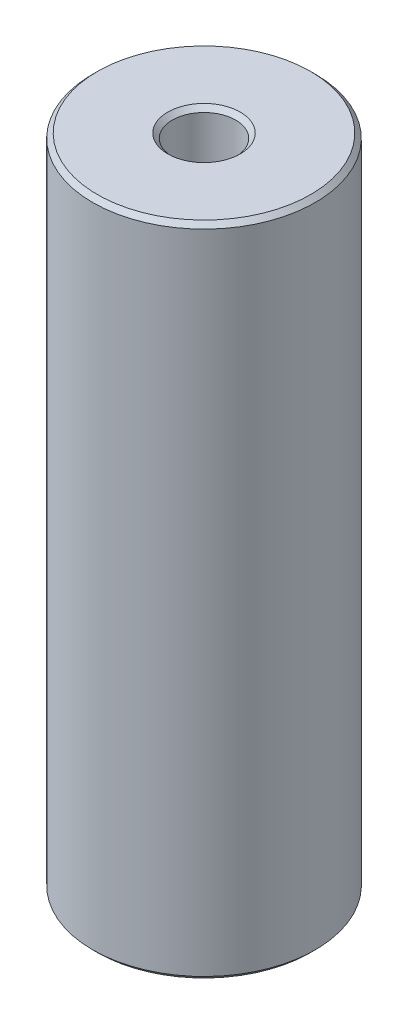
ISO-10303-21;
HEADER;
FILE_DESCRIPTION(('STEP AP214'),'2;1');
FILE_NAME('part.step','',(''),(''),'','','');
FILE_SCHEMA(('AUTOMOTIVE_DESIGN { 1 0 10303 214 1 1 1 1 }'));
ENDSEC;
DATA;
#1=APPLICATION_CONTEXT('core data for automotive mechanical design processes');
#2=APPLICATION_PROTOCOL_DEFINITION('international standard','automotive_design',2000,#1);
#3=PRODUCT_CONTEXT('',#1,'mechanical');
#4=PRODUCT('Part','Part','',(#3));
#5=PRODUCT_RELATED_PRODUCT_CATEGORY('part','',(#4));
#6=PRODUCT_DEFINITION_FORMATION('','',#4);
#7=PRODUCT_DEFINITION_CONTEXT('part definition',#1,'design');
#8=PRODUCT_DEFINITION('design','',#6,#7);
#9=PRODUCT_DEFINITION_SHAPE('','',#8);
#10=(LENGTH_UNIT() NAMED_UNIT(*) SI_UNIT(.MILLI.,.METRE.));
#11=(NAMED_UNIT(*) PLANE_ANGLE_UNIT() SI_UNIT($,.RADIAN.));
#12=(NAMED_UNIT(*) SI_UNIT($,.STERADIAN.) SOLID_ANGLE_UNIT());
#13=UNCERTAINTY_MEASURE_WITH_UNIT(LENGTH_MEASURE(1.E-05),#10,'distance_accuracy_value','');
#14=(GEOMETRIC_REPRESENTATION_CONTEXT(3) GLOBAL_UNCERTAINTY_ASSIGNED_CONTEXT((#13)) GLOBAL_UNIT_ASSIGNED_CONTEXT((#10,
#11,#12)) REPRESENTATION_CONTEXT('',''));
#15=CARTESIAN_POINT('',(0.,0.,0.));
#16=DIRECTION('',(0.,0.,1.));
#17=DIRECTION('',(1.,0.,0.));
#18=AXIS2_PLACEMENT_3D('',#15,#16,#17);
#19=CARTESIAN_POINT('',(0.,29.5032303433853,0.));
#20=DIRECTION('',(0.,-1.,0.));
#21=DIRECTION('',(0.,0.,-1.));
#22=AXIS2_PLACEMENT_3D('',#19,#20,#21);
#23=CYLINDRICAL_SURFACE('',#22,5.);
#24=CARTESIAN_POINT('',(0.,0.206618048334477,0.));
#25=DIRECTION('',(0.,1.,0.));
#26=DIRECTION('',(0.,0.,1.));
#27=AXIS2_PLACEMENT_3D('',#24,#25,#26);
#28=CIRCLE('',#27,5.);
#29=CARTESIAN_POINT('',(0.,0.206618048334477,5.));
#30=VERTEX_POINT('',#29);
#31=EDGE_CURVE('E10',#30,#30,#28,.T.);
#32=ORIENTED_EDGE('',*,*,#31,.T.);
#33=EDGE_LOOP('',(#32));
#34=FACE_BOUND('',#33,.T.);
#35=CARTESIAN_POINT('',(0.,29.2966122950508,0.));
#36=DIRECTION('',(0.,1.,0.));
#37=DIRECTION('',(0.,0.,1.));
#38=AXIS2_PLACEMENT_3D('',#35,#36,#37);
#39=CIRCLE('',#38,5.);
#40=CARTESIAN_POINT('',(0.,29.2966122950508,-5.));
#41=VERTEX_POINT('',#40);
#42=EDGE_CURVE('E50',#41,#41,#39,.F.);
#43=ORIENTED_EDGE('',*,*,#42,.T.);
#44=EDGE_LOOP('',(#43));
#45=FACE_BOUND('',#44,.T.);
#46=ADVANCED_FACE('F39',(#34,#45),#23,.T.);
#47=CARTESIAN_POINT('',(0.,29.5032303433853,0.));
#48=DIRECTION('',(0.,1.,0.));
#49=DIRECTION('',(0.,0.,1.));
#50=AXIS2_PLACEMENT_3D('',#47,#48,#49);
#51=PLANE('',#50);
#52=CARTESIAN_POINT('',(0.,29.5032303433853,0.));
#53=DIRECTION('',(0.,1.,0.));
#54=DIRECTION('',(0.,0.,1.));
#55=AXIS2_PLACEMENT_3D('',#52,#53,#54);
#56=CIRCLE('',#55,1.62997676149332);
#57=CARTESIAN_POINT('',(0.,29.5032303433853,1.62997676149332));
#58=VERTEX_POINT('',#57);
#59=EDGE_CURVE('E58',#58,#58,#56,.F.);
#60=ORIENTED_EDGE('',*,*,#59,.T.);
#61=EDGE_LOOP('',(#60));
#62=FACE_BOUND('',#61,.T.);
#63=CARTESIAN_POINT('',(0.,29.5032303433853,0.));
#64=DIRECTION('',(0.,1.,0.));
#65=DIRECTION('',(0.,0.,1.));
#66=AXIS2_PLACEMENT_3D('',#63,#64,#65);
#67=CIRCLE('',#66,4.79338195166553);
#68=CARTESIAN_POINT('',(0.,29.5032303433853,-4.79338195166554));
#69=VERTEX_POINT('',#68);
#70=EDGE_CURVE('E61',#69,#69,#67,.T.);
#71=ORIENTED_EDGE('',*,*,#70,.T.);
#72=EDGE_LOOP('',(#71));
#73=FACE_BOUND('',#72,.T.);
#74=ADVANCED_FACE('F88',(#62,#73),#51,.T.);
#75=CARTESIAN_POINT('',(0.,0.,0.));
#76=DIRECTION('',(0.,1.,0.));
#77=DIRECTION('',(0.,0.,1.));
#78=AXIS2_PLACEMENT_3D('',#75,#76,#77);
#79=PLANE('',#78);
#80=CARTESIAN_POINT('',(0.,0.,0.));
#81=DIRECTION('',(0.,1.,0.));
#82=DIRECTION('',(0.,0.,1.));
#83=AXIS2_PLACEMENT_3D('',#80,#81,#82);
#84=CIRCLE('',#83,1.62997676149332);
#85=CARTESIAN_POINT('',(0.,0.,-1.62997676149332));
#86=VERTEX_POINT('',#85);
#87=EDGE_CURVE('E51',#86,#86,#84,.T.);
#88=ORIENTED_EDGE('',*,*,#87,.T.);
#89=EDGE_LOOP('',(#88));
#90=FACE_BOUND('',#89,.T.);
#91=CARTESIAN_POINT('',(0.,0.,0.));
#92=DIRECTION('',(0.,1.,0.));
#93=DIRECTION('',(0.,0.,1.));
#94=AXIS2_PLACEMENT_3D('',#91,#92,#93);
#95=CIRCLE('',#94,4.79338195166552);
#96=CARTESIAN_POINT('',(0.,0.,4.79338195166552));
#97=VERTEX_POINT('',#96);
#98=EDGE_CURVE('E54',#97,#97,#95,.F.);
#99=ORIENTED_EDGE('',*,*,#98,.T.);
#100=EDGE_LOOP('',(#99));
#101=FACE_BOUND('',#100,.T.);
#102=ADVANCED_FACE('F83',(#90,#101),#79,.F.);
#103=CARTESIAN_POINT('',(0.,29.5032303433853,0.));
#104=DIRECTION('',(0.,-1.,0.));
#105=DIRECTION('',(0.,0.,-1.));
#106=AXIS2_PLACEMENT_3D('',#103,#104,#105);
#107=CYLINDRICAL_SURFACE('',#106,1.42335871315885);
#108=CARTESIAN_POINT('',(0.,29.2966122950508,0.));
#109=DIRECTION('',(0.,1.,0.));
#110=DIRECTION('',(0.,0.,1.));
#111=AXIS2_PLACEMENT_3D('',#108,#109,#110);
#112=CIRCLE('',#111,1.42335871315885);
#113=CARTESIAN_POINT('',(0.,29.2966122950508,-1.42335871315885));
#114=VERTEX_POINT('',#113);
#115=EDGE_CURVE('E67',#114,#114,#112,.T.);
#116=CARTESIAN_POINT('',(0.,0.206618048334471,0.));
#117=DIRECTION('',(0.,1.,0.));
#118=DIRECTION('',(0.,0.,1.));
#119=AXIS2_PLACEMENT_3D('',#116,#117,#118);
#120=CIRCLE('',#119,1.42335871315885);
#121=CARTESIAN_POINT('',(0.,0.206618048334471,-1.42335871315885));
#122=VERTEX_POINT('',#121);
#123=EDGE_CURVE('E69',#122,#122,#120,.F.);
#124=CARTESIAN_POINT('',(0.,29.2966122950508,-1.42335871315885));
#125=CARTESIAN_POINT('',(0.,28.9935915216475,-1.42335871315885));
#126=CARTESIAN_POINT('',(0.,28.6905707482442,-1.42335871315885));
#127=CARTESIAN_POINT('',(0.,28.0845292014376,-1.42335871315885));
#128=CARTESIAN_POINT('',(0.,27.7815084280343,-1.42335871315885));
#129=CARTESIAN_POINT('',(0.,27.1754668812277,-1.42335871315885));
#130=CARTESIAN_POINT('',(0.,26.8724461078244,-1.42335871315885));
#131=CARTESIAN_POINT('',(0.,26.2664045610178,-1.42335871315885));
#132=CARTESIAN_POINT('',(0.,25.9633837876145,-1.42335871315885));
#133=CARTESIAN_POINT('',(0.,25.357342240808,-1.42335871315885));
#134=CARTESIAN_POINT('',(0.,25.0543214674047,-1.42335871315885));
#135=CARTESIAN_POINT('',(0.,24.4482799205981,-1.42335871315885));
#136=CARTESIAN_POINT('',(0.,24.1452591471948,-1.42335871315885));
#137=CARTESIAN_POINT('',(0.,23.5392176003882,-1.42335871315885));
#138=CARTESIAN_POINT('',(0.,23.2361968269849,-1.42335871315885));
#139=CARTESIAN_POINT('',(0.,22.6301552801783,-1.42335871315885));
#140=CARTESIAN_POINT('',(0.,22.327134506775,-1.42335871315885));
#141=CARTESIAN_POINT('',(0.,21.7210929599684,-1.42335871315885));
#142=CARTESIAN_POINT('',(0.,21.4180721865651,-1.42335871315885));
#143=CARTESIAN_POINT('',(0.,20.8120306397585,-1.42335871315885));
#144=CARTESIAN_POINT('',(0.,20.5090098663552,-1.42335871315885));
#145=CARTESIAN_POINT('',(0.,19.9029683195486,-1.42335871315885));
#146=CARTESIAN_POINT('',(0.,19.5999475461454,-1.42335871315885));
#147=CARTESIAN_POINT('',(0.,18.9939059993388,-1.42335871315885));
#148=CARTESIAN_POINT('',(0.,18.6908852259355,-1.42335871315885));
#149=CARTESIAN_POINT('',(0.,18.0848436791289,-1.42335871315885));
#150=CARTESIAN_POINT('',(0.,17.7818229057256,-1.42335871315885));
#151=CARTESIAN_POINT('',(0.,17.175781358919,-1.42335871315885));
#152=CARTESIAN_POINT('',(0.,16.8727605855157,-1.42335871315885));
#153=CARTESIAN_POINT('',(0.,16.2667190387091,-1.42335871315885));
#154=CARTESIAN_POINT('',(0.,15.9636982653058,-1.42335871315885));
#155=CARTESIAN_POINT('',(0.,15.3576567184992,-1.42335871315885));
#156=CARTESIAN_POINT('',(0.,15.0546359450959,-1.42335871315885));
#157=CARTESIAN_POINT('',(0.,14.4485943982893,-1.42335871315885));
#158=CARTESIAN_POINT('',(0.,14.145573624886,-1.42335871315885));
#159=CARTESIAN_POINT('',(0.,13.5395320780795,-1.42335871315885));
#160=CARTESIAN_POINT('',(0.,13.2365113046762,-1.42335871315885));
#161=CARTESIAN_POINT('',(0.,12.6304697578696,-1.42335871315885));
#162=CARTESIAN_POINT('',(0.,12.3274489844663,-1.42335871315885));
#163=CARTESIAN_POINT('',(0.,11.7214074376597,-1.42335871315885));
#164=CARTESIAN_POINT('',(0.,11.4183866642564,-1.42335871315885));
#165=CARTESIAN_POINT('',(0.,10.8123451174498,-1.42335871315885));
#166=CARTESIAN_POINT('',(0.,10.5093243440465,-1.42335871315885));
#167=CARTESIAN_POINT('',(0.,9.90328279723991,-1.42335871315885));
#168=CARTESIAN_POINT('',(0.,9.60026202383662,-1.42335871315885));
#169=CARTESIAN_POINT('',(0.,8.99422047703003,-1.42335871315885));
#170=CARTESIAN_POINT('',(0.,8.69119970362673,-1.42335871315885));
#171=CARTESIAN_POINT('',(0.,8.08515815682014,-1.42335871315885));
#172=CARTESIAN_POINT('',(0.,7.78213738341685,-1.42335871315885));
#173=CARTESIAN_POINT('',(0.,7.17609583661026,-1.42335871315885));
#174=CARTESIAN_POINT('',(0.,6.87307506320696,-1.42335871315885));
#175=CARTESIAN_POINT('',(0.,6.26703351640037,-1.42335871315885));
#176=CARTESIAN_POINT('',(0.,5.96401274299708,-1.42335871315885));
#177=CARTESIAN_POINT('',(0.,5.35797119619049,-1.42335871315885));
#178=CARTESIAN_POINT('',(0.,5.05495042278719,-1.42335871315885));
#179=CARTESIAN_POINT('',(0.,4.4489088759806,-1.42335871315885));
#180=CARTESIAN_POINT('',(0.,4.14588810257731,-1.42335871315885));
#181=CARTESIAN_POINT('',(0.,3.53984655577072,-1.42335871315885));
#182=CARTESIAN_POINT('',(0.,3.23682578236742,-1.42335871315885));
#183=CARTESIAN_POINT('',(0.,2.63078423556083,-1.42335871315885));
#184=CARTESIAN_POINT('',(0.,2.32776346215754,-1.42335871315885));
#185=CARTESIAN_POINT('',(0.,1.72172191535095,-1.42335871315885));
#186=CARTESIAN_POINT('',(0.,1.41870114194765,-1.42335871315885));
#187=CARTESIAN_POINT('',(0.,0.812659595141063,-1.42335871315885));
#188=CARTESIAN_POINT('',(0.,0.509638821737767,-1.42335871315885));
#189=CARTESIAN_POINT('',(0.,0.206618048334471,-1.42335871315885));
#190=B_SPLINE_CURVE_WITH_KNOTS('',3,(#124,#125,#126,#127,#128,#129,#130,#131,#132,#133,#134,
#135,#136,#137,#138,#139,#140,#141,#142,#143,#144,#145,#146,#147,#148,#149,#150,#151,#152,#153,
#154,#155,#156,#157,#158,#159,#160,#161,#162,#163,#164,#165,#166,#167,#168,#169,#170,#171,#172,
#173,#174,#175,#176,#177,#178,#179,#180,#181,#182,#183,#184,#185,#186,#187,#188,#189),
.UNSPECIFIED.,.F.,.F.,(4,2,2,2,2,2,2,2,2,2,2,2,2,2,2,2,2,2,2,2,2,2,2,2,2,2,2,2,2,2,2,2,4),(0.,
0.909062320209889,1.81812464041977,2.72718696062966,3.63624928083954,4.54531160104943,
5.45437392125931,6.3634362414692,7.27249856167908,8.18156088188897,9.09062320209885,
9.99968552230874,10.9087478425186,11.8178101627285,12.7268724829384,13.6359348031483,
14.5449971233582,15.454059443568,16.3631217637779,17.2721840839878,18.1812464041977,
19.0903087244076,19.9993710446175,20.9084333648274,21.8174956850372,22.7265580052471,
23.635620325457,24.5446826456669,25.4537449658768,26.3628072860867,27.2718696062966,
28.1809319265064,29.0899942467163),.UNSPECIFIED.);
#191=EDGE_CURVE('BSEAM71',#114,#122,#190,.T.);
#192=ORIENTED_EDGE('',*,*,#115,.T.);
#193=ORIENTED_EDGE('',*,*,#123,.T.);
#194=ORIENTED_EDGE('',*,*,#191,.T.);
#195=ORIENTED_EDGE('',*,*,#191,.F.);
#196=EDGE_LOOP('',(#192,#194,#193,#195));
#197=FACE_BOUND('',#196,.T.);
#198=ADVANCED_FACE('F71',(#197),#107,.F.);
#199=CARTESIAN_POINT('',(0.,29.2966122950508,0.));
#200=DIRECTION('',(0.,1.,0.));
#201=DIRECTION('',(0.,0.,1.));
#202=AXIS2_PLACEMENT_3D('',#199,#200,#201);
#203=CONICAL_SURFACE('',#202,1.42335871315885,0.785398163397448);
#204=ORIENTED_EDGE('',*,*,#59,.F.);
#205=EDGE_LOOP('',(#204));
#206=FACE_BOUND('',#205,.T.);
#207=ORIENTED_EDGE('',*,*,#115,.F.);
#208=EDGE_LOOP('',(#207));
#209=FACE_BOUND('',#208,.T.);
#210=ADVANCED_FACE('F77',(#206,#209),#203,.F.);
#211=CARTESIAN_POINT('',(0.,0.,0.));
#212=DIRECTION('',(0.,-1.,0.));
#213=DIRECTION('',(0.,0.,-1.));
#214=AXIS2_PLACEMENT_3D('',#211,#212,#213);
#215=CONICAL_SURFACE('',#214,1.62997676149332,0.785398163397448);
#216=CARTESIAN_POINT('',(0.,0.206618048334471,-1.42335871315885));
#217=CARTESIAN_POINT('',(0.,0.204465776997653,-1.42551098449567));
#218=CARTESIAN_POINT('',(0.,0.202313505660836,-1.42766325583249));
#219=CARTESIAN_POINT('',(0.,0.198008962987201,-1.43196779850612));
#220=CARTESIAN_POINT('',(0.,0.195856691650383,-1.43412006984294));
#221=CARTESIAN_POINT('',(0.,0.191552148976749,-1.43842461251657));
#222=CARTESIAN_POINT('',(0.,0.189399877639931,-1.44057688385339));
#223=CARTESIAN_POINT('',(0.,0.185095334966296,-1.44488142652703));
#224=CARTESIAN_POINT('',(0.,0.182943063629479,-1.44703369786384));
#225=CARTESIAN_POINT('',(0.,0.178638520955844,-1.45133824053748));
#226=CARTESIAN_POINT('',(0.,0.176486249619027,-1.45349051187429));
#227=CARTESIAN_POINT('',(0.,0.172181706945392,-1.45779505454793));
#228=CARTESIAN_POINT('',(0.,0.170029435608575,-1.45994732588475));
#229=CARTESIAN_POINT('',(0.,0.16572489293494,-1.46425186855838));
#230=CARTESIAN_POINT('',(0.,0.163572621598122,-1.4664041398952));
#231=CARTESIAN_POINT('',(0.,0.159268078924488,-1.47070868256883));
#232=CARTESIAN_POINT('',(0.,0.15711580758767,-1.47286095390565));
#233=CARTESIAN_POINT('',(0.,0.152811264914035,-1.47716549657929));
#234=CARTESIAN_POINT('',(0.,0.150658993577218,-1.4793177679161));
#235=CARTESIAN_POINT('',(0.,0.146354450903583,-1.48362231058974));
#236=CARTESIAN_POINT('',(0.,0.144202179566766,-1.48577458192656));
#237=CARTESIAN_POINT('',(0.,0.139897636893131,-1.49007912460019));
#238=CARTESIAN_POINT('',(0.,0.137745365556314,-1.49223139593701));
#239=CARTESIAN_POINT('',(0.,0.133440822882679,-1.49653593861064));
#240=CARTESIAN_POINT('',(0.,0.131288551545861,-1.49868820994746));
#241=CARTESIAN_POINT('',(0.,0.126984008872227,-1.5029927526211));
#242=CARTESIAN_POINT('',(0.,0.124831737535409,-1.50514502395791));
#243=CARTESIAN_POINT('',(0.,0.120527194861774,-1.50944956663155));
#244=CARTESIAN_POINT('',(0.,0.118374923524957,-1.51160183796836));
#245=CARTESIAN_POINT('',(0.,0.114070380851322,-1.515906380642));
#246=CARTESIAN_POINT('',(0.,0.111918109514505,-1.51805865197882));
#247=CARTESIAN_POINT('',(0.,0.10761356684087,-1.52236319465245));
#248=CARTESIAN_POINT('',(0.,0.105461295504053,-1.52451546598927));
#249=CARTESIAN_POINT('',(0.,0.101156752830418,-1.5288200086629));
#250=CARTESIAN_POINT('',(0.,0.0990044814936005,-1.53097227999972));
#251=CARTESIAN_POINT('',(0.,0.0946999388199657,-1.53527682267336));
#252=CARTESIAN_POINT('',(0.,0.0925476674831483,-1.53742909401017));
#253=CARTESIAN_POINT('',(0.,0.0882431248095134,-1.54173363668381));
#254=CARTESIAN_POINT('',(0.,0.086090853472696,-1.54388590802063));
#255=CARTESIAN_POINT('',(0.,0.0817863107990612,-1.54819045069426));
#256=CARTESIAN_POINT('',(0.,0.0796340394622438,-1.55034272203108));
#257=CARTESIAN_POINT('',(0.,0.075329496788609,-1.55464726470471));
#258=CARTESIAN_POINT('',(0.,0.0731772254517917,-1.55679953604153));
#259=CARTESIAN_POINT('',(0.,0.0688726827781568,-1.56110407871517));
#260=CARTESIAN_POINT('',(0.,0.0667204114413394,-1.56325635005198));
#261=CARTESIAN_POINT('',(0.,0.0624158687677046,-1.56756089272562));
#262=CARTESIAN_POINT('',(0.,0.0602635974308872,-1.56971316406243));
#263=CARTESIAN_POINT('',(0.,0.0559590547572524,-1.57401770673607));
#264=CARTESIAN_POINT('',(0.,0.053806783420435,-1.57616997807289));
#265=CARTESIAN_POINT('',(0.,0.0495022407468002,-1.58047452074652));
#266=CARTESIAN_POINT('',(0.,0.0473499694099828,-1.58262679208334));
#267=CARTESIAN_POINT('',(0.,0.043045426736348,-1.58693133475697));
#268=CARTESIAN_POINT('',(0.,0.0408931553995306,-1.58908360609379));
#269=CARTESIAN_POINT('',(0.,0.0365886127258958,-1.59338814876743));
#270=CARTESIAN_POINT('',(0.,0.0344363413890784,-1.59554042010424));
#271=CARTESIAN_POINT('',(0.,0.0301317987154436,-1.59984496277788));
#272=CARTESIAN_POINT('',(0.,0.0279795273786262,-1.6019972341147));
#273=CARTESIAN_POINT('',(0.,0.0236749847049914,-1.60630177678833));
#274=CARTESIAN_POINT('',(0.,0.021522713368174,-1.60845404812515));
#275=CARTESIAN_POINT('',(0.,0.0172181706945392,-1.61275859079878));
#276=CARTESIAN_POINT('',(0.,0.0150658993577218,-1.6149108621356));
#277=CARTESIAN_POINT('',(0.,0.010761356684087,-1.61921540480923));
#278=CARTESIAN_POINT('',(0.,0.00860908534726959,-1.62136767614605));
#279=CARTESIAN_POINT('',(0.,0.00430454267363478,-1.62567221881969));
#280=CARTESIAN_POINT('',(0.,0.00215227133681737,-1.6278244901565));
#281=CARTESIAN_POINT('',(0.,0.,-1.62997676149332));
#282=B_SPLINE_CURVE_WITH_KNOTS('',3,(#216,#217,#218,#219,#220,#221,#222,#223,#224,#225,#226,
#227,#228,#229,#230,#231,#232,#233,#234,#235,#236,#237,#238,#239,#240,#241,#242,#243,#244,#245,
#246,#247,#248,#249,#250,#251,#252,#253,#254,#255,#256,#257,#258,#259,#260,#261,#262,#263,#264,
#265,#266,#267,#268,#269,#270,#271,#272,#273,#274,#275,#276,#277,#278,#279,#280,#281),
.UNSPECIFIED.,.F.,.F.,(4,2,2,2,2,2,2,2,2,2,2,2,2,2,2,2,2,2,2,2,2,2,2,2,2,2,2,2,2,2,2,2,4),(0.,
0.0091313139433022,0.0182626278866042,0.0273939418299063,0.0365252557732085,0.0456565697165107,
0.0547878836598127,0.0639191976031148,0.073050511546417,0.0821818254897192,0.0913131394330212,
0.100444453376323,0.109575767319625,0.118707081262928,0.12783839520623,0.136969709149532,
0.146101023092834,0.155232337036136,0.164363650979438,0.17349496492274,0.182626278866042,
0.191757592809345,0.200888906752647,0.210020220695949,0.219151534639251,0.228282848582553,
0.237414162525855,0.246545476469157,0.255676790412459,0.264808104355762,0.273939418299064,
0.283070732242366,0.292202046185668),.UNSPECIFIED.);
#283=EDGE_CURVE('BSEAM73',#122,#86,#282,.T.);
#284=ORIENTED_EDGE('',*,*,#123,.F.);
#285=ORIENTED_EDGE('',*,*,#87,.F.);
#286=ORIENTED_EDGE('',*,*,#283,.T.);
#287=ORIENTED_EDGE('',*,*,#283,.F.);
#288=EDGE_LOOP('',(#284,#286,#285,#287));
#289=FACE_BOUND('',#288,.T.);
#290=ADVANCED_FACE('F73',(#289),#215,.F.);
#291=CARTESIAN_POINT('',(0.,0.206618048334477,0.));
#292=DIRECTION('',(0.,1.,0.));
#293=DIRECTION('',(0.,0.,1.));
#294=AXIS2_PLACEMENT_3D('',#291,#292,#293);
#295=CONICAL_SURFACE('',#294,5.,0.785398163397446);
#296=ORIENTED_EDGE('',*,*,#98,.F.);
#297=EDGE_LOOP('',(#296));
#298=FACE_BOUND('',#297,.T.);
#299=ORIENTED_EDGE('',*,*,#31,.F.);
#300=EDGE_LOOP('',(#299));
#301=FACE_BOUND('',#300,.T.);
#302=ADVANCED_FACE('F76',(#298,#301),#295,.T.);
#303=CARTESIAN_POINT('',(0.,29.5032303433853,0.));
#304=DIRECTION('',(0.,-1.,0.));
#305=DIRECTION('',(0.,0.,-1.));
#306=AXIS2_PLACEMENT_3D('',#303,#304,#305);
#307=CONICAL_SURFACE('',#306,4.79338195166553,0.785398163397438);
#308=CARTESIAN_POINT('',(0.,29.2966122950508,-5.));
#309=CARTESIAN_POINT('',(0.,29.2987645663876,-4.99784772866319));
#310=CARTESIAN_POINT('',(0.,29.3009168377244,-4.99569545732637));
#311=CARTESIAN_POINT('',(0.,29.3052213803981,-4.99139091465273));
#312=CARTESIAN_POINT('',(0.,29.3073736517349,-4.98923864331592));
#313=CARTESIAN_POINT('',(0.,29.3116781944085,-4.98493410064228));
#314=CARTESIAN_POINT('',(0.,29.3138304657453,-4.98278182930546));
#315=CARTESIAN_POINT('',(0.,29.318135008419,-4.97847728663183));
#316=CARTESIAN_POINT('',(0.,29.3202872797558,-4.97632501529501));
#317=CARTESIAN_POINT('',(0.,29.3245918224294,-4.97202047262138));
#318=CARTESIAN_POINT('',(0.,29.3267440937662,-4.96986820128456));
#319=CARTESIAN_POINT('',(0.,29.3310486364399,-4.96556365861092));
#320=CARTESIAN_POINT('',(0.,29.3332009077767,-4.96341138727411));
#321=CARTESIAN_POINT('',(0.,29.3375054504503,-4.95910684460047));
#322=CARTESIAN_POINT('',(0.,29.3396577217871,-4.95695457326365));
#323=CARTESIAN_POINT('',(0.,29.3439622644608,-4.95265003059002));
#324=CARTESIAN_POINT('',(0.,29.3461145357976,-4.9504977592532));
#325=CARTESIAN_POINT('',(0.,29.3504190784712,-4.94619321657957));
#326=CARTESIAN_POINT('',(0.,29.352571349808,-4.94404094524275));
#327=CARTESIAN_POINT('',(0.,29.3568758924817,-4.93973640256912));
#328=CARTESIAN_POINT('',(0.,29.3590281638185,-4.9375841312323));
#329=CARTESIAN_POINT('',(0.,29.3633327064921,-4.93327958855866));
#330=CARTESIAN_POINT('',(0.,29.3654849778289,-4.93112731722185));
#331=CARTESIAN_POINT('',(0.,29.3697895205026,-4.92682277454821));
#332=CARTESIAN_POINT('',(0.,29.3719417918394,-4.92467050321139));
#333=CARTESIAN_POINT('',(0.,29.376246334513,-4.92036596053776));
#334=CARTESIAN_POINT('',(0.,29.3783986058499,-4.91821368920094));
#335=CARTESIAN_POINT('',(0.,29.3827031485235,-4.91390914652731));
#336=CARTESIAN_POINT('',(0.,29.3848554198603,-4.91175687519049));
#337=CARTESIAN_POINT('',(0.,29.3891599625339,-4.90745233251686));
#338=CARTESIAN_POINT('',(0.,29.3913122338708,-4.90530006118004));
#339=CARTESIAN_POINT('',(0.,29.3956167765444,-4.9009955185064));
#340=CARTESIAN_POINT('',(0.,29.3977690478812,-4.89884324716959));
#341=CARTESIAN_POINT('',(0.,29.4020735905548,-4.89453870449595));
#342=CARTESIAN_POINT('',(0.,29.4042258618917,-4.89238643315913));
#343=CARTESIAN_POINT('',(0.,29.4085304045653,-4.8880818904855));
#344=CARTESIAN_POINT('',(0.,29.4106826759021,-4.88592961914868));
#345=CARTESIAN_POINT('',(0.,29.4149872185758,-4.88162507647505));
#346=CARTESIAN_POINT('',(0.,29.4171394899126,-4.87947280513823));
#347=CARTESIAN_POINT('',(0.,29.4214440325862,-4.8751682624646));
#348=CARTESIAN_POINT('',(0.,29.423596303923,-4.87301599112778));
#349=CARTESIAN_POINT('',(0.,29.4279008465967,-4.86871144845414));
#350=CARTESIAN_POINT('',(0.,29.4300531179335,-4.86655917711733));
#351=CARTESIAN_POINT('',(0.,29.4343576606071,-4.86225463444369));
#352=CARTESIAN_POINT('',(0.,29.4365099319439,-4.86010236310687));
#353=CARTESIAN_POINT('',(0.,29.4408144746176,-4.85579782043324));
#354=CARTESIAN_POINT('',(0.,29.4429667459544,-4.85364554909642));
#355=CARTESIAN_POINT('',(0.,29.447271288628,-4.84934100642279));
#356=CARTESIAN_POINT('',(0.,29.4494235599648,-4.84718873508597));
#357=CARTESIAN_POINT('',(0.,29.4537281026385,-4.84288419241233));
#358=CARTESIAN_POINT('',(0.,29.4558803739753,-4.84073192107552));
#359=CARTESIAN_POINT('',(0.,29.4601849166489,-4.83642737840188));
#360=CARTESIAN_POINT('',(0.,29.4623371879857,-4.83427510706507));
#361=CARTESIAN_POINT('',(0.,29.4666417306594,-4.82997056439143));
#362=CARTESIAN_POINT('',(0.,29.4687940019962,-4.82781829305461));
#363=CARTESIAN_POINT('',(0.,29.4730985446698,-4.82351375038098));
#364=CARTESIAN_POINT('',(0.,29.4752508160066,-4.82136147904416));
#365=CARTESIAN_POINT('',(0.,29.4795553586803,-4.81705693637053));
#366=CARTESIAN_POINT('',(0.,29.4817076300171,-4.81490466503371));
#367=CARTESIAN_POINT('',(0.,29.4860121726907,-4.81060012236007));
#368=CARTESIAN_POINT('',(0.,29.4881644440275,-4.80844785102326));
#369=CARTESIAN_POINT('',(0.,29.4924689867012,-4.80414330834962));
#370=CARTESIAN_POINT('',(0.,29.494621258038,-4.8019910370128));
#371=CARTESIAN_POINT('',(0.,29.4989258007116,-4.79768649433917));
#372=CARTESIAN_POINT('',(0.,29.5010780720484,-4.79553422300235));
#373=CARTESIAN_POINT('',(0.,29.5032303433853,-4.79338195166554));
#374=B_SPLINE_CURVE_WITH_KNOTS('',3,(#308,#309,#310,#311,#312,#313,#314,#315,#316,#317,#318,
#319,#320,#321,#322,#323,#324,#325,#326,#327,#328,#329,#330,#331,#332,#333,#334,#335,#336,#337,
#338,#339,#340,#341,#342,#343,#344,#345,#346,#347,#348,#349,#350,#351,#352,#353,#354,#355,#356,
#357,#358,#359,#360,#361,#362,#363,#364,#365,#366,#367,#368,#369,#370,#371,#372,#373),
.UNSPECIFIED.,.F.,.F.,(4,2,2,2,2,2,2,2,2,2,2,2,2,2,2,2,2,2,2,2,2,2,2,2,2,2,2,2,2,2,2,2,4),(0.,
0.00913131394330381,0.0182626278866052,0.0273939418299065,0.0365252557732103,0.0456565697165117,
0.054787883659813,0.0639191976031144,0.0730505115464182,0.0821818254897196,0.0913131394330209,
0.100444453376325,0.109575767319626,0.118707081262927,0.127838395206229,0.136969709149532,
0.146101023092833,0.155232337036135,0.164363650979439,0.17349496492274,0.182626278866041,
0.191757592809343,0.200888906752646,0.210020220695948,0.219151534639249,0.228282848582553,
0.237414162525854,0.246545476469156,0.255676790412457,0.264808104355761,0.273939418299062,
0.283070732242364,0.292202046185667),.UNSPECIFIED.);
#375=EDGE_CURVE('BSEAM45',#41,#69,#374,.T.);
#376=ORIENTED_EDGE('',*,*,#42,.F.);
#377=ORIENTED_EDGE('',*,*,#70,.F.);
#378=ORIENTED_EDGE('',*,*,#375,.T.);
#379=ORIENTED_EDGE('',*,*,#375,.F.);
#380=EDGE_LOOP('',(#376,#378,#377,#379));
#381=FACE_BOUND('',#380,.T.);
#382=ADVANCED_FACE('F45',(#381),#307,.T.);
#383=CLOSED_SHELL('',(#46,#74,#102,#198,#210,#290,#302,#382));
#384=MANIFOLD_SOLID_BREP('B2',#383);
#385=ADVANCED_BREP_SHAPE_REPRESENTATION('',(#18,#384),#14);
#386=SHAPE_DEFINITION_REPRESENTATION(#9,#385);
ENDSEC;
END-ISO-10303-21;
